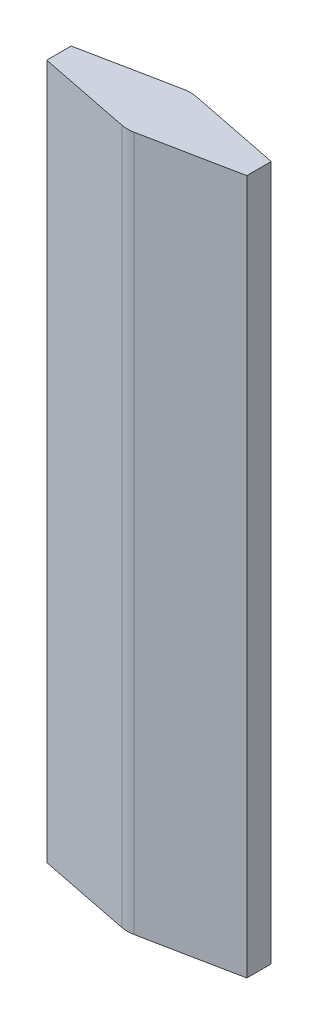
ISO-10303-21;
HEADER;
FILE_DESCRIPTION(('STEP AP214'),'2;1');
FILE_NAME('part.step','',(''),(''),'','','');
FILE_SCHEMA(('AUTOMOTIVE_DESIGN { 1 0 10303 214 1 1 1 1 }'));
ENDSEC;
DATA;
#1=APPLICATION_CONTEXT('core data for automotive mechanical design processes');
#2=APPLICATION_PROTOCOL_DEFINITION('international standard','automotive_design',2000,#1);
#3=PRODUCT_CONTEXT('',#1,'mechanical');
#4=PRODUCT('Part','Part','',(#3));
#5=PRODUCT_RELATED_PRODUCT_CATEGORY('part','',(#4));
#6=PRODUCT_DEFINITION_FORMATION('','',#4);
#7=PRODUCT_DEFINITION_CONTEXT('part definition',#1,'design');
#8=PRODUCT_DEFINITION('design','',#6,#7);
#9=PRODUCT_DEFINITION_SHAPE('','',#8);
#10=(LENGTH_UNIT() NAMED_UNIT(*) SI_UNIT(.MILLI.,.METRE.));
#11=(NAMED_UNIT(*) PLANE_ANGLE_UNIT() SI_UNIT($,.RADIAN.));
#12=(NAMED_UNIT(*) SI_UNIT($,.STERADIAN.) SOLID_ANGLE_UNIT());
#13=UNCERTAINTY_MEASURE_WITH_UNIT(LENGTH_MEASURE(1.E-05),#10,'distance_accuracy_value','');
#14=(GEOMETRIC_REPRESENTATION_CONTEXT(3) GLOBAL_UNCERTAINTY_ASSIGNED_CONTEXT((#13)) GLOBAL_UNIT_ASSIGNED_CONTEXT((#10,
#11,#12)) REPRESENTATION_CONTEXT('',''));
#15=CARTESIAN_POINT('',(0.,0.,0.));
#16=DIRECTION('',(0.,0.,1.));
#17=DIRECTION('',(1.,0.,0.));
#18=AXIS2_PLACEMENT_3D('',#15,#16,#17);
#19=CARTESIAN_POINT('',(-181.96,650.,24.8171969436686));
#20=DIRECTION('',(0.196,0.,-0.9806038955664));
#21=DIRECTION('',(-0.9806038955664,0.,-0.196));
#22=AXIS2_PLACEMENT_3D('',#19,#20,#21);
#23=PLANE('',#22);
#24=DIRECTION('',(0.9806038955664,0.,0.196));
#25=VECTOR('',#24,1.);
#26=CARTESIAN_POINT('',(-181.96,-660.,24.8171969436686));
#27=LINE('',#26,#25);
#28=CARTESIAN_POINT('',(-190.,-660.,23.2101872151484));
#29=VERTEX_POINT('',#28);
#30=CARTESIAN_POINT('',(-11.7599999999999,-660.,58.836233733984));
#31=VERTEX_POINT('',#30);
#32=EDGE_CURVE('E149',#29,#31,#27,.T.);
#33=ORIENTED_EDGE('',*,*,#32,.T.);
#34=DIRECTION('',(0.,-1.,0.));
#35=VECTOR('',#34,1.);
#36=CARTESIAN_POINT('',(-11.7599999999999,650.,58.836233733984));
#37=LINE('',#36,#35);
#38=CARTESIAN_POINT('',(-11.7599999999999,660.,58.836233733984));
#39=VERTEX_POINT('',#38);
#40=EDGE_CURVE('E289',#39,#31,#37,.T.);
#41=ORIENTED_EDGE('',*,*,#40,.F.);
#42=DIRECTION('',(0.9806038955664,0.,0.196));
#43=VECTOR('',#42,1.);
#44=CARTESIAN_POINT('',(-181.96,660.,24.8171969436686));
#45=LINE('',#44,#43);
#46=CARTESIAN_POINT('',(-190.,660.,23.2101872151484));
#47=VERTEX_POINT('',#46);
#48=EDGE_CURVE('E214',#47,#39,#45,.T.);
#49=ORIENTED_EDGE('',*,*,#48,.F.);
#50=DIRECTION('',(0.,-1.,0.));
#51=VECTOR('',#50,1.);
#52=CARTESIAN_POINT('',(-190.,650.,23.2101872151484));
#53=LINE('',#52,#51);
#54=EDGE_CURVE('E287',#47,#29,#53,.T.);
#55=ORIENTED_EDGE('',*,*,#54,.T.);
#56=EDGE_LOOP('',(#33,#41,#49,#55));
#57=FACE_BOUND('',#56,.T.);
#58=ADVANCED_FACE('F40',(#57),#23,.F.);
#59=CARTESIAN_POINT('',(0.,650.,0.));
#60=DIRECTION('',(0.,-1.,0.));
#61=DIRECTION('',(0.,0.,-1.));
#62=AXIS2_PLACEMENT_3D('',#59,#60,#61);
#63=CYLINDRICAL_SURFACE('',#62,60.);
#64=CARTESIAN_POINT('',(0.,-660.,0.));
#65=DIRECTION('',(0.,1.,0.));
#66=DIRECTION('',(0.,0.,1.));
#67=AXIS2_PLACEMENT_3D('',#64,#65,#66);
#68=CIRCLE('',#67,60.);
#69=CARTESIAN_POINT('',(11.76,-660.,58.836233733984));
#70=VERTEX_POINT('',#69);
#71=EDGE_CURVE('E296',#31,#70,#68,.T.);
#72=ORIENTED_EDGE('',*,*,#71,.T.);
#73=DIRECTION('',(0.,1.,0.));
#74=VECTOR('',#73,1.);
#75=CARTESIAN_POINT('',(11.76,650.,58.836233733984));
#76=LINE('',#75,#74);
#77=CARTESIAN_POINT('',(11.76,660.,58.836233733984));
#78=VERTEX_POINT('',#77);
#79=EDGE_CURVE('E292',#78,#70,#76,.F.);
#80=ORIENTED_EDGE('',*,*,#79,.F.);
#81=CARTESIAN_POINT('',(0.,660.,0.));
#82=DIRECTION('',(0.,1.,0.));
#83=DIRECTION('',(0.,0.,1.));
#84=AXIS2_PLACEMENT_3D('',#81,#82,#83);
#85=CIRCLE('',#84,60.);
#86=EDGE_CURVE('E304',#39,#78,#85,.T.);
#87=ORIENTED_EDGE('',*,*,#86,.F.);
#88=ORIENTED_EDGE('',*,*,#40,.T.);
#89=EDGE_LOOP('',(#72,#80,#87,#88));
#90=FACE_BOUND('',#89,.T.);
#91=ADVANCED_FACE('F349',(#90),#63,.T.);
#92=CARTESIAN_POINT('',(11.76,650.,58.836233733984));
#93=DIRECTION('',(-0.196,0.,-0.9806038955664));
#94=DIRECTION('',(-0.980603895566401,0.,0.196));
#95=AXIS2_PLACEMENT_3D('',#92,#93,#94);
#96=PLANE('',#95);
#97=DIRECTION('',(0.980603895566401,0.,-0.196));
#98=VECTOR('',#97,1.);
#99=CARTESIAN_POINT('',(11.76,-660.,58.836233733984));
#100=LINE('',#99,#98);
#101=CARTESIAN_POINT('',(190.,-660.,23.2101872151484));
#102=VERTEX_POINT('',#101);
#103=EDGE_CURVE('E299',#70,#102,#100,.T.);
#104=ORIENTED_EDGE('',*,*,#103,.T.);
#105=DIRECTION('',(0.,-1.,0.));
#106=VECTOR('',#105,1.);
#107=CARTESIAN_POINT('',(190.,650.,23.2101872151484));
#108=LINE('',#107,#106);
#109=CARTESIAN_POINT('',(190.,660.,23.2101872151484));
#110=VERTEX_POINT('',#109);
#111=EDGE_CURVE('E303',#110,#102,#108,.T.);
#112=ORIENTED_EDGE('',*,*,#111,.F.);
#113=DIRECTION('',(0.980603895566401,0.,-0.196));
#114=VECTOR('',#113,1.);
#115=CARTESIAN_POINT('',(11.76,660.,58.836233733984));
#116=LINE('',#115,#114);
#117=EDGE_CURVE('E307',#78,#110,#116,.T.);
#118=ORIENTED_EDGE('',*,*,#117,.F.);
#119=ORIENTED_EDGE('',*,*,#79,.T.);
#120=EDGE_LOOP('',(#104,#112,#118,#119));
#121=FACE_BOUND('',#120,.T.);
#122=ADVANCED_FACE('F345',(#121),#96,.F.);
#123=CARTESIAN_POINT('',(190.,650.,0.));
#124=DIRECTION('',(-1.,0.,0.));
#125=DIRECTION('',(0.,0.,1.));
#126=AXIS2_PLACEMENT_3D('',#123,#124,#125);
#127=PLANE('',#126);
#128=DIRECTION('',(0.,0.,-1.));
#129=VECTOR('',#128,1.);
#130=CARTESIAN_POINT('',(190.,-660.,0.));
#131=LINE('',#130,#129);
#132=CARTESIAN_POINT('',(190.,-660.,-23.2101872151484));
#133=VERTEX_POINT('',#132);
#134=EDGE_CURVE('E311',#102,#133,#131,.T.);
#135=ORIENTED_EDGE('',*,*,#134,.T.);
#136=DIRECTION('',(0.,-1.,0.));
#137=VECTOR('',#136,1.);
#138=CARTESIAN_POINT('',(190.,650.,-23.2101872151484));
#139=LINE('',#138,#137);
#140=CARTESIAN_POINT('',(190.,660.,-23.2101872151484));
#141=VERTEX_POINT('',#140);
#142=EDGE_CURVE('E315',#141,#133,#139,.T.);
#143=ORIENTED_EDGE('',*,*,#142,.F.);
#144=DIRECTION('',(0.,0.,-1.));
#145=VECTOR('',#144,1.);
#146=CARTESIAN_POINT('',(190.,660.,0.));
#147=LINE('',#146,#145);
#148=EDGE_CURVE('E318',#110,#141,#147,.T.);
#149=ORIENTED_EDGE('',*,*,#148,.F.);
#150=ORIENTED_EDGE('',*,*,#111,.T.);
#151=EDGE_LOOP('',(#135,#143,#149,#150));
#152=FACE_BOUND('',#151,.T.);
#153=ADVANCED_FACE('F338',(#152),#127,.F.);
#154=CARTESIAN_POINT('',(181.96,650.,-24.8171969436686));
#155=DIRECTION('',(-0.196,0.,0.9806038955664));
#156=DIRECTION('',(0.980603895566401,0.,0.196));
#157=AXIS2_PLACEMENT_3D('',#154,#155,#156);
#158=PLANE('',#157);
#159=DIRECTION('',(-0.980603895566401,0.,-0.196));
#160=VECTOR('',#159,1.);
#161=CARTESIAN_POINT('',(181.96,-660.,-24.8171969436686));
#162=LINE('',#161,#160);
#163=CARTESIAN_POINT('',(11.76,-660.,-58.836233733984));
#164=VERTEX_POINT('',#163);
#165=EDGE_CURVE('E179',#133,#164,#162,.T.);
#166=ORIENTED_EDGE('',*,*,#165,.T.);
#167=DIRECTION('',(0.,-1.,0.));
#168=VECTOR('',#167,1.);
#169=CARTESIAN_POINT('',(11.76,650.,-58.836233733984));
#170=LINE('',#169,#168);
#171=CARTESIAN_POINT('',(11.76,660.,-58.836233733984));
#172=VERTEX_POINT('',#171);
#173=EDGE_CURVE('E189',#172,#164,#170,.T.);
#174=ORIENTED_EDGE('',*,*,#173,.F.);
#175=DIRECTION('',(-0.980603895566401,0.,-0.196));
#176=VECTOR('',#175,1.);
#177=CARTESIAN_POINT('',(181.96,660.,-24.8171969436686));
#178=LINE('',#177,#176);
#179=EDGE_CURVE('E325',#141,#172,#178,.T.);
#180=ORIENTED_EDGE('',*,*,#179,.F.);
#181=ORIENTED_EDGE('',*,*,#142,.T.);
#182=EDGE_LOOP('',(#166,#174,#180,#181));
#183=FACE_BOUND('',#182,.T.);
#184=ADVANCED_FACE('F336',(#183),#158,.F.);
#185=CARTESIAN_POINT('',(0.,650.,0.));
#186=DIRECTION('',(0.,-1.,0.));
#187=DIRECTION('',(0.,0.,-1.));
#188=AXIS2_PLACEMENT_3D('',#185,#186,#187);
#189=CYLINDRICAL_SURFACE('',#188,60.);
#190=CARTESIAN_POINT('',(0.,-660.,0.));
#191=DIRECTION('',(0.,1.,0.));
#192=DIRECTION('',(0.,0.,1.));
#193=AXIS2_PLACEMENT_3D('',#190,#191,#192);
#194=CIRCLE('',#193,60.);
#195=CARTESIAN_POINT('',(-11.7599999672993,-660.,-58.8362337405201));
#196=VERTEX_POINT('',#195);
#197=EDGE_CURVE('E184',#164,#196,#194,.T.);
#198=ORIENTED_EDGE('',*,*,#197,.T.);
#199=DIRECTION('',(0.,1.,0.));
#200=VECTOR('',#199,1.);
#201=CARTESIAN_POINT('',(-11.7599999672993,650.,-58.8362337405201));
#202=LINE('',#201,#200);
#203=CARTESIAN_POINT('',(-11.7599999672993,660.,-58.8362337405201));
#204=VERTEX_POINT('',#203);
#205=EDGE_CURVE('E187',#204,#196,#202,.F.);
#206=ORIENTED_EDGE('',*,*,#205,.F.);
#207=CARTESIAN_POINT('',(0.,660.,0.));
#208=DIRECTION('',(0.,1.,0.));
#209=DIRECTION('',(0.,0.,1.));
#210=AXIS2_PLACEMENT_3D('',#207,#208,#209);
#211=CIRCLE('',#210,60.);
#212=EDGE_CURVE('E127',#172,#204,#211,.T.);
#213=ORIENTED_EDGE('',*,*,#212,.F.);
#214=ORIENTED_EDGE('',*,*,#173,.T.);
#215=EDGE_LOOP('',(#198,#206,#213,#214));
#216=FACE_BOUND('',#215,.T.);
#217=ADVANCED_FACE('F186',(#216),#189,.T.);
#218=CARTESIAN_POINT('',(-11.7599999672993,650.,-58.8362337405201));
#219=DIRECTION('',(0.196,0.,0.9806038955664));
#220=DIRECTION('',(0.9806038955664,0.,-0.196));
#221=AXIS2_PLACEMENT_3D('',#218,#219,#220);
#222=PLANE('',#221);
#223=DIRECTION('',(-0.9806038955664,0.,0.196));
#224=VECTOR('',#223,1.);
#225=CARTESIAN_POINT('',(-11.7599999672993,-660.,-58.8362337405201));
#226=LINE('',#225,#224);
#227=CARTESIAN_POINT('',(-190.,-660.,-23.2101872151484));
#228=VERTEX_POINT('',#227);
#229=EDGE_CURVE('E193',#196,#228,#226,.T.);
#230=ORIENTED_EDGE('',*,*,#229,.T.);
#231=DIRECTION('',(0.,-1.,0.));
#232=VECTOR('',#231,1.);
#233=CARTESIAN_POINT('',(-190.,650.,-23.2101872151484));
#234=LINE('',#233,#232);
#235=CARTESIAN_POINT('',(-190.,660.,-23.2101872151484));
#236=VERTEX_POINT('',#235);
#237=EDGE_CURVE('E200',#236,#228,#234,.T.);
#238=ORIENTED_EDGE('',*,*,#237,.F.);
#239=DIRECTION('',(-0.9806038955664,0.,0.196));
#240=VECTOR('',#239,1.);
#241=CARTESIAN_POINT('',(-11.7599999672993,660.,-58.8362337405201));
#242=LINE('',#241,#240);
#243=EDGE_CURVE('E198',#204,#236,#242,.T.);
#244=ORIENTED_EDGE('',*,*,#243,.F.);
#245=ORIENTED_EDGE('',*,*,#205,.T.);
#246=EDGE_LOOP('',(#230,#238,#244,#245));
#247=FACE_BOUND('',#246,.T.);
#248=ADVANCED_FACE('F196',(#247),#222,.F.);
#249=CARTESIAN_POINT('',(-190.,650.,0.));
#250=DIRECTION('',(1.,0.,0.));
#251=DIRECTION('',(0.,0.,-1.));
#252=AXIS2_PLACEMENT_3D('',#249,#250,#251);
#253=PLANE('',#252);
#254=DIRECTION('',(0.,0.,1.));
#255=VECTOR('',#254,1.);
#256=CARTESIAN_POINT('',(-190.,-660.,0.));
#257=LINE('',#256,#255);
#258=EDGE_CURVE('E141',#228,#29,#257,.T.);
#259=ORIENTED_EDGE('',*,*,#258,.T.);
#260=ORIENTED_EDGE('',*,*,#54,.F.);
#261=DIRECTION('',(0.,0.,1.));
#262=VECTOR('',#261,1.);
#263=CARTESIAN_POINT('',(-190.,660.,0.));
#264=LINE('',#263,#262);
#265=EDGE_CURVE('E119',#236,#47,#264,.T.);
#266=ORIENTED_EDGE('',*,*,#265,.F.);
#267=ORIENTED_EDGE('',*,*,#237,.T.);
#268=EDGE_LOOP('',(#259,#260,#266,#267));
#269=FACE_BOUND('',#268,.T.);
#270=ADVANCED_FACE('F368',(#269),#253,.F.);
#271=CARTESIAN_POINT('',(0.,660.,0.));
#272=DIRECTION('',(0.,1.,0.));
#273=DIRECTION('',(0.,0.,1.));
#274=AXIS2_PLACEMENT_3D('',#271,#272,#273);
#275=PLANE('',#274);
#276=ORIENTED_EDGE('',*,*,#265,.T.);
#277=ORIENTED_EDGE('',*,*,#48,.T.);
#278=ORIENTED_EDGE('',*,*,#86,.T.);
#279=ORIENTED_EDGE('',*,*,#117,.T.);
#280=ORIENTED_EDGE('',*,*,#148,.T.);
#281=ORIENTED_EDGE('',*,*,#179,.T.);
#282=ORIENTED_EDGE('',*,*,#212,.T.);
#283=ORIENTED_EDGE('',*,*,#243,.T.);
#284=EDGE_LOOP('',(#276,#277,#278,#279,#280,#281,#282,#283));
#285=FACE_BOUND('',#284,.T.);
#286=ADVANCED_FACE('F333',(#285),#275,.T.);
#287=CARTESIAN_POINT('',(0.,-660.,0.));
#288=DIRECTION('',(0.,1.,0.));
#289=DIRECTION('',(0.,0.,1.));
#290=AXIS2_PLACEMENT_3D('',#287,#288,#289);
#291=PLANE('',#290);
#292=ORIENTED_EDGE('',*,*,#32,.F.);
#293=ORIENTED_EDGE('',*,*,#258,.F.);
#294=ORIENTED_EDGE('',*,*,#229,.F.);
#295=ORIENTED_EDGE('',*,*,#197,.F.);
#296=ORIENTED_EDGE('',*,*,#165,.F.);
#297=ORIENTED_EDGE('',*,*,#134,.F.);
#298=ORIENTED_EDGE('',*,*,#103,.F.);
#299=ORIENTED_EDGE('',*,*,#71,.F.);
#300=EDGE_LOOP('',(#292,#293,#294,#295,#296,#297,#298,#299));
#301=FACE_BOUND('',#300,.T.);
#302=ADVANCED_FACE('F202',(#301),#291,.F.);
#303=CLOSED_SHELL('',(#58,#91,#122,#153,#184,#217,#248,#270,#286,#302));
#304=CARTESIAN_POINT('',(-180.,650.,15.0111579880046));
#305=DIRECTION('',(0.196,0.,-0.9806038955664));
#306=DIRECTION('',(-0.9806038955664,0.,-0.196));
#307=AXIS2_PLACEMENT_3D('',#304,#305,#306);
#308=PLANE('',#307);
#309=DIRECTION('',(0.9806038955664,0.,0.196));
#310=VECTOR('',#309,1.);
#311=CARTESIAN_POINT('',(-180.,-650.,15.0111579880046));
#312=LINE('',#311,#310);
#313=CARTESIAN_POINT('',(-180.,-650.,15.0111579880046));
#314=VERTEX_POINT('',#313);
#315=CARTESIAN_POINT('',(-9.79999999999995,-650.,49.03019477832));
#316=VERTEX_POINT('',#315);
#317=EDGE_CURVE('E44',#314,#316,#312,.T.);
#318=ORIENTED_EDGE('',*,*,#317,.F.);
#319=DIRECTION('',(0.,-1.,0.));
#320=VECTOR('',#319,1.);
#321=CARTESIAN_POINT('',(-180.,650.,15.0111579880046));
#322=LINE('',#321,#320);
#323=CARTESIAN_POINT('',(-180.,650.,15.0111579880046));
#324=VERTEX_POINT('',#323);
#325=EDGE_CURVE('E280',#324,#314,#322,.T.);
#326=ORIENTED_EDGE('',*,*,#325,.F.);
#327=DIRECTION('',(0.9806038955664,0.,0.196));
#328=VECTOR('',#327,1.);
#329=CARTESIAN_POINT('',(-180.,650.,15.0111579880046));
#330=LINE('',#329,#328);
#331=CARTESIAN_POINT('',(-9.79999999999995,650.,49.03019477832));
#332=VERTEX_POINT('',#331);
#333=EDGE_CURVE('E107',#324,#332,#330,.T.);
#334=ORIENTED_EDGE('',*,*,#333,.T.);
#335=DIRECTION('',(0.,-1.,0.));
#336=VECTOR('',#335,1.);
#337=CARTESIAN_POINT('',(-9.79999999999995,650.,49.03019477832));
#338=LINE('',#337,#336);
#339=EDGE_CURVE('E275',#332,#316,#338,.T.);
#340=ORIENTED_EDGE('',*,*,#339,.T.);
#341=EDGE_LOOP('',(#318,#326,#334,#340));
#342=FACE_BOUND('',#341,.T.);
#343=ADVANCED_FACE('F380',(#342),#308,.T.);
#344=CARTESIAN_POINT('',(0.,650.,0.));
#345=DIRECTION('',(0.,-1.,0.));
#346=DIRECTION('',(0.,0.,-1.));
#347=AXIS2_PLACEMENT_3D('',#344,#345,#346);
#348=CYLINDRICAL_SURFACE('',#347,50.);
#349=CARTESIAN_POINT('',(0.,-650.,0.));
#350=DIRECTION('',(0.,1.,0.));
#351=DIRECTION('',(0.,0.,1.));
#352=AXIS2_PLACEMENT_3D('',#349,#350,#351);
#353=CIRCLE('',#352,50.);
#354=CARTESIAN_POINT('',(9.79999999999999,-650.,49.03019477832));
#355=VERTEX_POINT('',#354);
#356=EDGE_CURVE('E278',#316,#355,#353,.T.);
#357=ORIENTED_EDGE('',*,*,#356,.F.);
#358=ORIENTED_EDGE('',*,*,#339,.F.);
#359=CARTESIAN_POINT('',(0.,650.,0.));
#360=DIRECTION('',(0.,1.,0.));
#361=DIRECTION('',(0.,0.,1.));
#362=AXIS2_PLACEMENT_3D('',#359,#360,#361);
#363=CIRCLE('',#362,50.);
#364=CARTESIAN_POINT('',(9.79999999999999,650.,49.03019477832));
#365=VERTEX_POINT('',#364);
#366=EDGE_CURVE('E227',#332,#365,#363,.T.);
#367=ORIENTED_EDGE('',*,*,#366,.T.);
#368=DIRECTION('',(0.,-1.,0.));
#369=VECTOR('',#368,1.);
#370=CARTESIAN_POINT('',(9.79999999999999,650.,49.03019477832));
#371=LINE('',#370,#369);
#372=EDGE_CURVE('E268',#365,#355,#371,.T.);
#373=ORIENTED_EDGE('',*,*,#372,.T.);
#374=EDGE_LOOP('',(#357,#358,#367,#373));
#375=FACE_BOUND('',#374,.T.);
#376=ADVANCED_FACE('F383',(#375),#348,.F.);
#377=CARTESIAN_POINT('',(9.79999999999999,650.,49.03019477832));
#378=DIRECTION('',(-0.196,0.,-0.9806038955664));
#379=DIRECTION('',(-0.980603895566401,0.,0.196));
#380=AXIS2_PLACEMENT_3D('',#377,#378,#379);
#381=PLANE('',#380);
#382=DIRECTION('',(0.9806038955664,0.,-0.196));
#383=VECTOR('',#382,1.);
#384=CARTESIAN_POINT('',(9.79999999999999,-650.,49.03019477832));
#385=LINE('',#384,#383);
#386=CARTESIAN_POINT('',(180.,-650.,15.0111579880046));
#387=VERTEX_POINT('',#386);
#388=EDGE_CURVE('E272',#355,#387,#385,.T.);
#389=ORIENTED_EDGE('',*,*,#388,.F.);
#390=ORIENTED_EDGE('',*,*,#372,.F.);
#391=DIRECTION('',(0.9806038955664,0.,-0.196));
#392=VECTOR('',#391,1.);
#393=CARTESIAN_POINT('',(9.79999999999999,650.,49.03019477832));
#394=LINE('',#393,#392);
#395=CARTESIAN_POINT('',(180.,650.,15.0111579880046));
#396=VERTEX_POINT('',#395);
#397=EDGE_CURVE('E224',#365,#396,#394,.T.);
#398=ORIENTED_EDGE('',*,*,#397,.T.);
#399=DIRECTION('',(0.,-1.,0.));
#400=VECTOR('',#399,1.);
#401=CARTESIAN_POINT('',(180.,650.,15.0111579880046));
#402=LINE('',#401,#400);
#403=EDGE_CURVE('E262',#396,#387,#402,.T.);
#404=ORIENTED_EDGE('',*,*,#403,.T.);
#405=EDGE_LOOP('',(#389,#390,#398,#404));
#406=FACE_BOUND('',#405,.T.);
#407=ADVANCED_FACE('F388',(#406),#381,.T.);
#408=CARTESIAN_POINT('',(180.,650.,0.));
#409=DIRECTION('',(-1.,0.,0.));
#410=DIRECTION('',(0.,0.,1.));
#411=AXIS2_PLACEMENT_3D('',#408,#409,#410);
#412=PLANE('',#411);
#413=DIRECTION('',(0.,0.,-1.));
#414=VECTOR('',#413,1.);
#415=CARTESIAN_POINT('',(180.,-650.,0.));
#416=LINE('',#415,#414);
#417=CARTESIAN_POINT('',(180.,-650.,-15.0111579880046));
#418=VERTEX_POINT('',#417);
#419=EDGE_CURVE('E61',#387,#418,#416,.T.);
#420=ORIENTED_EDGE('',*,*,#419,.F.);
#421=ORIENTED_EDGE('',*,*,#403,.F.);
#422=DIRECTION('',(0.,0.,-1.));
#423=VECTOR('',#422,1.);
#424=CARTESIAN_POINT('',(180.,650.,0.));
#425=LINE('',#424,#423);
#426=CARTESIAN_POINT('',(180.,650.,-15.0111579880046));
#427=VERTEX_POINT('',#426);
#428=EDGE_CURVE('E221',#396,#427,#425,.T.);
#429=ORIENTED_EDGE('',*,*,#428,.T.);
#430=DIRECTION('',(0.,-1.,0.));
#431=VECTOR('',#430,1.);
#432=CARTESIAN_POINT('',(180.,650.,-15.0111579880046));
#433=LINE('',#432,#431);
#434=EDGE_CURVE('E256',#427,#418,#433,.T.);
#435=ORIENTED_EDGE('',*,*,#434,.T.);
#436=EDGE_LOOP('',(#420,#421,#429,#435));
#437=FACE_BOUND('',#436,.T.);
#438=ADVANCED_FACE('F392',(#437),#412,.T.);
#439=CARTESIAN_POINT('',(180.,650.,-15.0111579880046));
#440=DIRECTION('',(-0.196,0.,0.9806038955664));
#441=DIRECTION('',(0.980603895566401,0.,0.196));
#442=AXIS2_PLACEMENT_3D('',#439,#440,#441);
#443=PLANE('',#442);
#444=DIRECTION('',(-0.9806038955664,0.,-0.196));
#445=VECTOR('',#444,1.);
#446=CARTESIAN_POINT('',(180.,-650.,-15.0111579880046));
#447=LINE('',#446,#445);
#448=CARTESIAN_POINT('',(9.80000000000001,-650.,-49.03019477832));
#449=VERTEX_POINT('',#448);
#450=EDGE_CURVE('E259',#418,#449,#447,.T.);
#451=ORIENTED_EDGE('',*,*,#450,.F.);
#452=ORIENTED_EDGE('',*,*,#434,.F.);
#453=DIRECTION('',(-0.9806038955664,0.,-0.196));
#454=VECTOR('',#453,1.);
#455=CARTESIAN_POINT('',(180.,650.,-15.0111579880046));
#456=LINE('',#455,#454);
#457=CARTESIAN_POINT('',(9.80000000000001,650.,-49.03019477832));
#458=VERTEX_POINT('',#457);
#459=EDGE_CURVE('E218',#427,#458,#456,.T.);
#460=ORIENTED_EDGE('',*,*,#459,.T.);
#461=DIRECTION('',(0.,-1.,0.));
#462=VECTOR('',#461,1.);
#463=CARTESIAN_POINT('',(9.80000000000001,650.,-49.03019477832));
#464=LINE('',#463,#462);
#465=EDGE_CURVE('E249',#458,#449,#464,.T.);
#466=ORIENTED_EDGE('',*,*,#465,.T.);
#467=EDGE_LOOP('',(#451,#452,#460,#466));
#468=FACE_BOUND('',#467,.T.);
#469=ADVANCED_FACE('F396',(#468),#443,.T.);
#470=CARTESIAN_POINT('',(0.,650.,0.));
#471=DIRECTION('',(0.,-1.,0.));
#472=DIRECTION('',(0.,0.,-1.));
#473=AXIS2_PLACEMENT_3D('',#470,#471,#472);
#474=CYLINDRICAL_SURFACE('',#473,50.);
#475=CARTESIAN_POINT('',(0.,-650.,0.));
#476=DIRECTION('',(0.,1.,0.));
#477=DIRECTION('',(0.,0.,1.));
#478=AXIS2_PLACEMENT_3D('',#475,#476,#477);
#479=CIRCLE('',#478,50.);
#480=CARTESIAN_POINT('',(-9.79999996729933,-650.,-49.0301947848561));
#481=VERTEX_POINT('',#480);
#482=EDGE_CURVE('E253',#449,#481,#479,.T.);
#483=ORIENTED_EDGE('',*,*,#482,.F.);
#484=ORIENTED_EDGE('',*,*,#465,.F.);
#485=CARTESIAN_POINT('',(0.,650.,0.));
#486=DIRECTION('',(0.,1.,0.));
#487=DIRECTION('',(0.,0.,1.));
#488=AXIS2_PLACEMENT_3D('',#485,#486,#487);
#489=CIRCLE('',#488,50.);
#490=CARTESIAN_POINT('',(-9.79999996729933,650.,-49.0301947848561));
#491=VERTEX_POINT('',#490);
#492=EDGE_CURVE('E52',#458,#491,#489,.T.);
#493=ORIENTED_EDGE('',*,*,#492,.T.);
#494=DIRECTION('',(0.,-1.,0.));
#495=VECTOR('',#494,1.);
#496=CARTESIAN_POINT('',(-9.79999996729933,650.,-49.0301947848561));
#497=LINE('',#496,#495);
#498=EDGE_CURVE('E242',#491,#481,#497,.T.);
#499=ORIENTED_EDGE('',*,*,#498,.T.);
#500=EDGE_LOOP('',(#483,#484,#493,#499));
#501=FACE_BOUND('',#500,.T.);
#502=ADVANCED_FACE('F399',(#501),#474,.F.);
#503=CARTESIAN_POINT('',(-9.79999996729933,650.,-49.0301947848561));
#504=DIRECTION('',(0.196,0.,0.9806038955664));
#505=DIRECTION('',(0.9806038955664,0.,-0.196));
#506=AXIS2_PLACEMENT_3D('',#503,#504,#505);
#507=PLANE('',#506);
#508=DIRECTION('',(-0.9806038955664,0.,0.196));
#509=VECTOR('',#508,1.);
#510=CARTESIAN_POINT('',(-9.79999996729933,-650.,-49.0301947848561));
#511=LINE('',#510,#509);
#512=CARTESIAN_POINT('',(-180.,-650.,-15.0111579880046));
#513=VERTEX_POINT('',#512);
#514=EDGE_CURVE('E246',#481,#513,#511,.T.);
#515=ORIENTED_EDGE('',*,*,#514,.F.);
#516=ORIENTED_EDGE('',*,*,#498,.F.);
#517=DIRECTION('',(-0.9806038955664,0.,0.196));
#518=VECTOR('',#517,1.);
#519=CARTESIAN_POINT('',(-9.79999996729933,650.,-49.0301947848561));
#520=LINE('',#519,#518);
#521=CARTESIAN_POINT('',(-180.,650.,-15.0111579880046));
#522=VERTEX_POINT('',#521);
#523=EDGE_CURVE('E11',#491,#522,#520,.T.);
#524=ORIENTED_EDGE('',*,*,#523,.T.);
#525=DIRECTION('',(0.,-1.,0.));
#526=VECTOR('',#525,1.);
#527=CARTESIAN_POINT('',(-180.,650.,-15.0111579880046));
#528=LINE('',#527,#526);
#529=EDGE_CURVE('E235',#522,#513,#528,.T.);
#530=ORIENTED_EDGE('',*,*,#529,.T.);
#531=EDGE_LOOP('',(#515,#516,#524,#530));
#532=FACE_BOUND('',#531,.T.);
#533=ADVANCED_FACE('F403',(#532),#507,.T.);
#534=CARTESIAN_POINT('',(-180.,650.,0.));
#535=DIRECTION('',(1.,0.,0.));
#536=DIRECTION('',(0.,0.,-1.));
#537=AXIS2_PLACEMENT_3D('',#534,#535,#536);
#538=PLANE('',#537);
#539=DIRECTION('',(0.,0.,1.));
#540=VECTOR('',#539,1.);
#541=CARTESIAN_POINT('',(-180.,-650.,0.));
#542=LINE('',#541,#540);
#543=EDGE_CURVE('E239',#513,#314,#542,.T.);
#544=ORIENTED_EDGE('',*,*,#543,.F.);
#545=ORIENTED_EDGE('',*,*,#529,.F.);
#546=DIRECTION('',(0.,0.,1.));
#547=VECTOR('',#546,1.);
#548=CARTESIAN_POINT('',(-180.,650.,0.));
#549=LINE('',#548,#547);
#550=EDGE_CURVE('E232',#522,#324,#549,.T.);
#551=ORIENTED_EDGE('',*,*,#550,.T.);
#552=ORIENTED_EDGE('',*,*,#325,.T.);
#553=EDGE_LOOP('',(#544,#545,#551,#552));
#554=FACE_BOUND('',#553,.T.);
#555=ADVANCED_FACE('F407',(#554),#538,.T.);
#556=CARTESIAN_POINT('',(0.,650.,0.));
#557=DIRECTION('',(0.,1.,0.));
#558=DIRECTION('',(0.,0.,1.));
#559=AXIS2_PLACEMENT_3D('',#556,#557,#558);
#560=PLANE('',#559);
#561=ORIENTED_EDGE('',*,*,#550,.F.);
#562=ORIENTED_EDGE('',*,*,#523,.F.);
#563=ORIENTED_EDGE('',*,*,#492,.F.);
#564=ORIENTED_EDGE('',*,*,#459,.F.);
#565=ORIENTED_EDGE('',*,*,#428,.F.);
#566=ORIENTED_EDGE('',*,*,#397,.F.);
#567=ORIENTED_EDGE('',*,*,#366,.F.);
#568=ORIENTED_EDGE('',*,*,#333,.F.);
#569=EDGE_LOOP('',(#561,#562,#563,#564,#565,#566,#567,#568));
#570=FACE_BOUND('',#569,.T.);
#571=ADVANCED_FACE('F410',(#570),#560,.F.);
#572=CARTESIAN_POINT('',(0.,-650.,0.));
#573=DIRECTION('',(0.,1.,0.));
#574=DIRECTION('',(0.,0.,1.));
#575=AXIS2_PLACEMENT_3D('',#572,#573,#574);
#576=PLANE('',#575);
#577=ORIENTED_EDGE('',*,*,#317,.T.);
#578=ORIENTED_EDGE('',*,*,#356,.T.);
#579=ORIENTED_EDGE('',*,*,#388,.T.);
#580=ORIENTED_EDGE('',*,*,#419,.T.);
#581=ORIENTED_EDGE('',*,*,#450,.T.);
#582=ORIENTED_EDGE('',*,*,#482,.T.);
#583=ORIENTED_EDGE('',*,*,#514,.T.);
#584=ORIENTED_EDGE('',*,*,#543,.T.);
#585=EDGE_LOOP('',(#577,#578,#579,#580,#581,#582,#583,#584));
#586=FACE_BOUND('',#585,.T.);
#587=ADVANCED_FACE('F42',(#586),#576,.T.);
#588=CLOSED_SHELL('',(#343,#376,#407,#438,#469,#502,#533,#555,#571,#587));
#589=ORIENTED_CLOSED_SHELL('',*,#588,.T.);
#590=BREP_WITH_VOIDS('B2',#303,(#589));
#591=ADVANCED_BREP_SHAPE_REPRESENTATION('',(#18,#590),#14);
#592=SHAPE_DEFINITION_REPRESENTATION(#9,#591);
ENDSEC;
END-ISO-10303-21;
